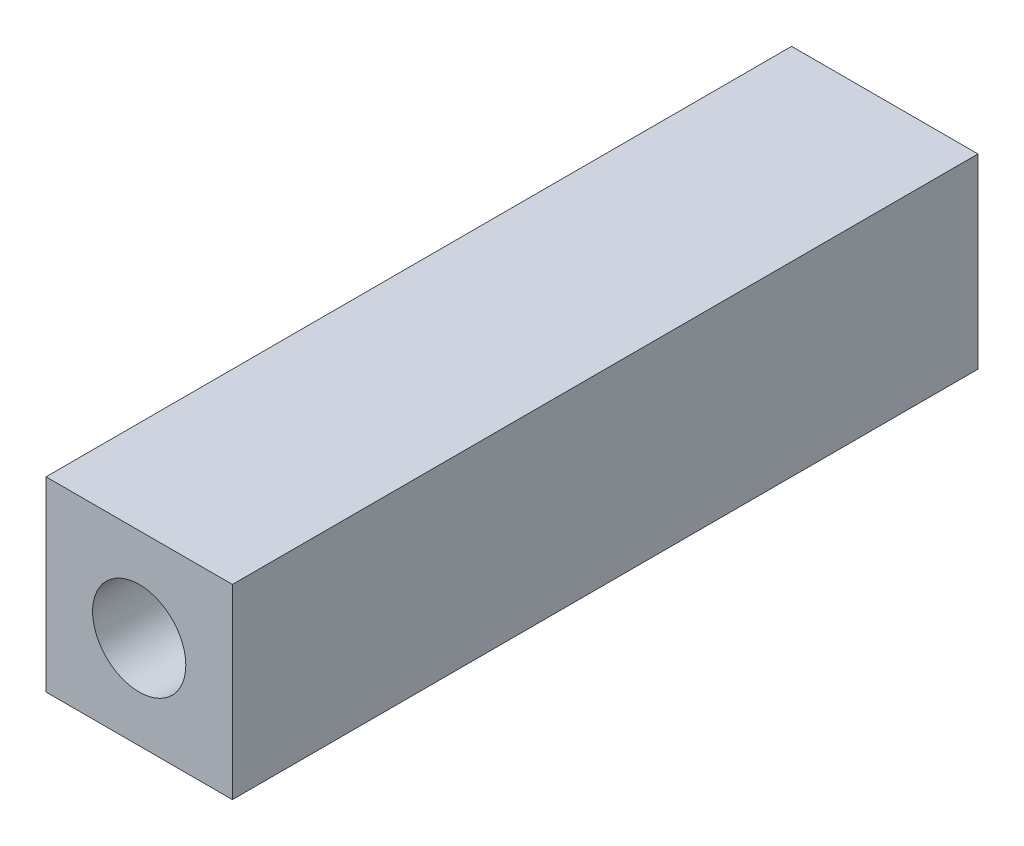
ISO-10303-21;
HEADER;
FILE_DESCRIPTION(('STEP AP214'),'2;1');
FILE_NAME('part.step','',(''),(''),'','','');
FILE_SCHEMA(('AUTOMOTIVE_DESIGN { 1 0 10303 214 1 1 1 1 }'));
ENDSEC;
DATA;
#1=APPLICATION_CONTEXT('core data for automotive mechanical design processes');
#2=APPLICATION_PROTOCOL_DEFINITION('international standard','automotive_design',2000,#1);
#3=PRODUCT_CONTEXT('',#1,'mechanical');
#4=PRODUCT('Part','Part','',(#3));
#5=PRODUCT_RELATED_PRODUCT_CATEGORY('part','',(#4));
#6=PRODUCT_DEFINITION_FORMATION('','',#4);
#7=PRODUCT_DEFINITION_CONTEXT('part definition',#1,'design');
#8=PRODUCT_DEFINITION('design','',#6,#7);
#9=PRODUCT_DEFINITION_SHAPE('','',#8);
#10=(LENGTH_UNIT() NAMED_UNIT(*) SI_UNIT(.MILLI.,.METRE.));
#11=(NAMED_UNIT(*) PLANE_ANGLE_UNIT() SI_UNIT($,.RADIAN.));
#12=(NAMED_UNIT(*) SI_UNIT($,.STERADIAN.) SOLID_ANGLE_UNIT());
#13=UNCERTAINTY_MEASURE_WITH_UNIT(LENGTH_MEASURE(1.E-05),#10,'distance_accuracy_value','');
#14=(GEOMETRIC_REPRESENTATION_CONTEXT(3) GLOBAL_UNCERTAINTY_ASSIGNED_CONTEXT((#13)) GLOBAL_UNIT_ASSIGNED_CONTEXT((#10,
#11,#12)) REPRESENTATION_CONTEXT('',''));
#15=CARTESIAN_POINT('',(0.,0.,0.));
#16=DIRECTION('',(0.,0.,1.));
#17=DIRECTION('',(1.,0.,0.));
#18=AXIS2_PLACEMENT_3D('',#15,#16,#17);
#19=CARTESIAN_POINT('',(-5.,-4.99999999999964,40.0000000000002));
#20=DIRECTION('',(0.,0.,-1.00000000000003));
#21=DIRECTION('',(-1.,0.,0.));
#22=AXIS2_PLACEMENT_3D('',#19,#20,#21);
#23=PLANE('',#22);
#24=DIRECTION('',(0.,-1.,0.));
#25=VECTOR('',#24,1.);
#26=CARTESIAN_POINT('',(-5.,-4.99999999999964,40.0000000000002));
#27=LINE('',#26,#25);
#28=CARTESIAN_POINT('',(-4.99999999999895,4.99999999999837,39.9999999999999));
#29=VERTEX_POINT('',#28);
#30=CARTESIAN_POINT('',(-5.,-4.99999999999964,40.0000000000002));
#31=VERTEX_POINT('',#30);
#32=EDGE_CURVE('E99',#29,#31,#27,.T.);
#33=ORIENTED_EDGE('',*,*,#32,.T.);
#34=DIRECTION('',(1.,0.,0.));
#35=VECTOR('',#34,1.);
#36=CARTESIAN_POINT('',(-5.,-4.99999999999964,40.0000000000002));
#37=LINE('',#36,#35);
#38=CARTESIAN_POINT('',(5.,-4.99999999999964,40.));
#39=VERTEX_POINT('',#38);
#40=EDGE_CURVE('E102',#31,#39,#37,.T.);
#41=ORIENTED_EDGE('',*,*,#40,.T.);
#42=DIRECTION('',(0.,1.,0.));
#43=VECTOR('',#42,1.);
#44=CARTESIAN_POINT('',(5.,-4.99999999999964,40.));
#45=LINE('',#44,#43);
#46=CARTESIAN_POINT('',(5.00000000000023,4.99999999999978,40.0000000000001));
#47=VERTEX_POINT('',#46);
#48=EDGE_CURVE('E104',#39,#47,#45,.T.);
#49=ORIENTED_EDGE('',*,*,#48,.T.);
#50=DIRECTION('',(-1.,0.,0.));
#51=VECTOR('',#50,1.);
#52=CARTESIAN_POINT('',(-4.99999999999895,4.99999999999837,39.9999999999999));
#53=LINE('',#52,#51);
#54=EDGE_CURVE('E106',#47,#29,#53,.T.);
#55=ORIENTED_EDGE('',*,*,#54,.T.);
#56=EDGE_LOOP('',(#33,#41,#49,#55));
#57=FACE_BOUND('',#56,.T.);
#58=CARTESIAN_POINT('',(1.11022302462516E-13,2.4980018054066E-13,40.0000000000001));
#59=DIRECTION('',(0.,0.,1.00000000000003));
#60=DIRECTION('',(1.,0.,0.));
#61=AXIS2_PLACEMENT_3D('',#58,#59,#60);
#62=CIRCLE('',#61,2.5);
#63=CARTESIAN_POINT('',(2.50000000000012,2.49414204567255E-13,40.0000000000001));
#64=VERTEX_POINT('',#63);
#65=EDGE_CURVE('E77',#64,#64,#62,.T.);
#66=ORIENTED_EDGE('',*,*,#65,.F.);
#67=EDGE_LOOP('',(#66));
#68=FACE_BOUND('',#67,.T.);
#69=ADVANCED_FACE('F16',(#57,#68),#23,.F.);
#70=CARTESIAN_POINT('',(-5.00000000000006,-5.00000000000012,-6.10622663543836E-13));
#71=DIRECTION('',(0.,0.,-1.00000000000003));
#72=DIRECTION('',(-1.,0.,0.));
#73=AXIS2_PLACEMENT_3D('',#70,#71,#72);
#74=PLANE('',#73);
#75=DIRECTION('',(0.,-1.,0.));
#76=VECTOR('',#75,1.);
#77=CARTESIAN_POINT('',(-5.00000000000006,-5.00000000000012,-6.10622663543836E-13));
#78=LINE('',#77,#76);
#79=CARTESIAN_POINT('',(-4.99999999999573,4.99999999999892,-2.22044604925031E-12));
#80=VERTEX_POINT('',#79);
#81=CARTESIAN_POINT('',(-5.00000000000006,-5.00000000000012,-6.10622663543836E-13));
#82=VERTEX_POINT('',#81);
#83=EDGE_CURVE('E84',#80,#82,#78,.T.);
#84=ORIENTED_EDGE('',*,*,#83,.F.);
#85=DIRECTION('',(-1.,0.,0.));
#86=VECTOR('',#85,1.);
#87=CARTESIAN_POINT('',(-4.99999999999573,4.99999999999892,-2.22044604925031E-12));
#88=LINE('',#87,#86);
#89=CARTESIAN_POINT('',(5.00000000000089,4.99999999999645,-1.33226762955019E-12));
#90=VERTEX_POINT('',#89);
#91=EDGE_CURVE('E97',#90,#80,#88,.T.);
#92=ORIENTED_EDGE('',*,*,#91,.F.);
#93=DIRECTION('',(0.,1.,0.));
#94=VECTOR('',#93,1.);
#95=CARTESIAN_POINT('',(5.00000000000356,-5.0000000000017,-1.66533453693773E-12));
#96=LINE('',#95,#94);
#97=CARTESIAN_POINT('',(5.00000000000356,-5.0000000000017,-1.66533453693773E-12));
#98=VERTEX_POINT('',#97);
#99=EDGE_CURVE('E95',#98,#90,#96,.T.);
#100=ORIENTED_EDGE('',*,*,#99,.F.);
#101=DIRECTION('',(1.,0.,0.));
#102=VECTOR('',#101,1.);
#103=CARTESIAN_POINT('',(-5.00000000000006,-5.00000000000012,-6.10622663543836E-13));
#104=LINE('',#103,#102);
#105=EDGE_CURVE('E93',#82,#98,#104,.T.);
#106=ORIENTED_EDGE('',*,*,#105,.F.);
#107=EDGE_LOOP('',(#84,#92,#100,#106));
#108=FACE_BOUND('',#107,.T.);
#109=CARTESIAN_POINT('',(1.11022302462516E-13,0.,-6.10622663543836E-13));
#110=DIRECTION('',(0.,0.,1.00000000000003));
#111=DIRECTION('',(1.,0.,0.));
#112=AXIS2_PLACEMENT_3D('',#109,#110,#111);
#113=CIRCLE('',#112,2.5);
#114=CARTESIAN_POINT('',(2.50000000000012,0.,-6.44206910038747E-13));
#115=VERTEX_POINT('',#114);
#116=EDGE_CURVE('E80',#115,#115,#113,.T.);
#117=ORIENTED_EDGE('',*,*,#116,.T.);
#118=EDGE_LOOP('',(#117));
#119=FACE_BOUND('',#118,.T.);
#120=ADVANCED_FACE('F130',(#108,#119),#74,.T.);
#121=CARTESIAN_POINT('',(-5.,-4.99999999999964,40.0000000000002));
#122=DIRECTION('',(1.,0.,0.));
#123=DIRECTION('',(0.,0.,-1.00000000000003));
#124=AXIS2_PLACEMENT_3D('',#121,#122,#123);
#125=PLANE('',#124);
#126=CARTESIAN_POINT('',(-4.99999999999856,0.,4.99999999999889));
#127=DIRECTION('',(1.,0.,0.));
#128=DIRECTION('',(0.,0.,-1.00000000000003));
#129=AXIS2_PLACEMENT_3D('',#126,#127,#128);
#130=CIRCLE('',#129,2.5);
#131=CARTESIAN_POINT('',(-4.99999999999853,0.,2.49999999999882));
#132=VERTEX_POINT('',#131);
#133=EDGE_CURVE('E82',#132,#132,#130,.T.);
#134=ORIENTED_EDGE('',*,*,#133,.T.);
#135=EDGE_LOOP('',(#134));
#136=FACE_BOUND('',#135,.T.);
#137=ORIENTED_EDGE('',*,*,#83,.T.);
#138=DIRECTION('',(0.,0.,-1.00000000000003));
#139=VECTOR('',#138,1.);
#140=CARTESIAN_POINT('',(-5.,-4.99999999999964,40.0000000000002));
#141=LINE('',#140,#139);
#142=EDGE_CURVE('E117',#31,#82,#141,.T.);
#143=ORIENTED_EDGE('',*,*,#142,.F.);
#144=ORIENTED_EDGE('',*,*,#32,.F.);
#145=DIRECTION('',(0.,0.,-1.00000000000003));
#146=VECTOR('',#145,1.);
#147=CARTESIAN_POINT('',(-4.99999999999895,4.99999999999837,39.9999999999999));
#148=LINE('',#147,#146);
#149=EDGE_CURVE('E108',#29,#80,#148,.T.);
#150=ORIENTED_EDGE('',*,*,#149,.T.);
#151=EDGE_LOOP('',(#137,#143,#144,#150));
#152=FACE_BOUND('',#151,.T.);
#153=ADVANCED_FACE('F18',(#136,#152),#125,.F.);
#154=CARTESIAN_POINT('',(-5.,-4.99999999999964,40.0000000000002));
#155=DIRECTION('',(0.,1.,0.));
#156=DIRECTION('',(0.,0.,1.00000000000003));
#157=AXIS2_PLACEMENT_3D('',#154,#155,#156);
#158=PLANE('',#157);
#159=CARTESIAN_POINT('',(0.,-5.,30.));
#160=DIRECTION('',(0.,1.,0.));
#161=DIRECTION('',(0.,0.,1.00000000000003));
#162=AXIS2_PLACEMENT_3D('',#159,#160,#161);
#163=CIRCLE('',#162,2.5);
#164=CARTESIAN_POINT('',(0.,-5.00000000000001,32.5000000000001));
#165=VERTEX_POINT('',#164);
#166=EDGE_CURVE('E87',#165,#165,#163,.T.);
#167=ORIENTED_EDGE('',*,*,#166,.T.);
#168=EDGE_LOOP('',(#167));
#169=FACE_BOUND('',#168,.T.);
#170=ORIENTED_EDGE('',*,*,#105,.T.);
#171=DIRECTION('',(0.,0.,-1.00000000000003));
#172=VECTOR('',#171,1.);
#173=CARTESIAN_POINT('',(5.,-4.99999999999964,40.));
#174=LINE('',#173,#172);
#175=EDGE_CURVE('E114',#39,#98,#174,.T.);
#176=ORIENTED_EDGE('',*,*,#175,.F.);
#177=ORIENTED_EDGE('',*,*,#40,.F.);
#178=ORIENTED_EDGE('',*,*,#142,.T.);
#179=EDGE_LOOP('',(#170,#176,#177,#178));
#180=FACE_BOUND('',#179,.T.);
#181=ADVANCED_FACE('F129',(#169,#180),#158,.F.);
#182=CARTESIAN_POINT('',(5.,-4.99999999999964,40.));
#183=DIRECTION('',(-1.,0.,0.));
#184=DIRECTION('',(0.,0.,1.00000000000003));
#185=AXIS2_PLACEMENT_3D('',#182,#183,#184);
#186=PLANE('',#185);
#187=ORIENTED_EDGE('',*,*,#99,.T.);
#188=DIRECTION('',(0.,0.,-1.00000000000003));
#189=VECTOR('',#188,1.);
#190=CARTESIAN_POINT('',(5.00000000000023,4.99999999999978,40.0000000000001));
#191=LINE('',#190,#189);
#192=EDGE_CURVE('E111',#47,#90,#191,.T.);
#193=ORIENTED_EDGE('',*,*,#192,.F.);
#194=ORIENTED_EDGE('',*,*,#48,.F.);
#195=ORIENTED_EDGE('',*,*,#175,.T.);
#196=EDGE_LOOP('',(#187,#193,#194,#195));
#197=FACE_BOUND('',#196,.T.);
#198=ADVANCED_FACE('F147',(#197),#186,.F.);
#199=CARTESIAN_POINT('',(-4.99999999999895,4.99999999999837,39.9999999999999));
#200=DIRECTION('',(0.,-1.,0.));
#201=DIRECTION('',(1.,0.,0.));
#202=AXIS2_PLACEMENT_3D('',#199,#200,#201);
#203=PLANE('',#202);
#204=ORIENTED_EDGE('',*,*,#91,.T.);
#205=ORIENTED_EDGE('',*,*,#149,.F.);
#206=ORIENTED_EDGE('',*,*,#54,.F.);
#207=ORIENTED_EDGE('',*,*,#192,.T.);
#208=EDGE_LOOP('',(#204,#205,#206,#207));
#209=FACE_BOUND('',#208,.T.);
#210=ADVANCED_FACE('F71',(#209),#203,.F.);
#211=CARTESIAN_POINT('',(1.11022302462516E-13,2.4980018054066E-13,40.0000000000001));
#212=DIRECTION('',(0.,0.,-1.00000000000003));
#213=DIRECTION('',(-1.,0.,0.));
#214=AXIS2_PLACEMENT_3D('',#211,#212,#213);
#215=CYLINDRICAL_SURFACE('',#214,2.5);
#216=CARTESIAN_POINT('',(0.,-1.97064586870965E-12,30.));
#217=DIRECTION('',(0.,0.707106781186549,-0.707106781186563));
#218=DIRECTION('',(0.,-0.707106781186549,-0.707106781186562));
#219=AXIS2_PLACEMENT_3D('',#216,#217,#218);
#220=ELLIPSE('',#219,3.53553390593274,2.5);
#221=CARTESIAN_POINT('',(2.50000000000017,-1.85962356624714E-12,29.9999999999991));
#222=VERTEX_POINT('',#221);
#223=CARTESIAN_POINT('',(-2.50000000000017,-1.97064586870965E-12,29.9999999999993));
#224=VERTEX_POINT('',#223);
#225=EDGE_CURVE('E11',#222,#224,#220,.T.);
#226=ORIENTED_EDGE('',*,*,#225,.F.);
#227=CARTESIAN_POINT('',(0.,-1.97064586870965E-12,30.));
#228=DIRECTION('',(0.,-0.707106781186549,-0.707106781186562));
#229=DIRECTION('',(0.,0.707106781186549,-0.707106781186563));
#230=AXIS2_PLACEMENT_3D('',#227,#228,#229);
#231=ELLIPSE('',#230,3.53553390593274,2.5);
#232=EDGE_CURVE('E24',#224,#222,#231,.F.);
#233=ORIENTED_EDGE('',*,*,#232,.F.);
#234=EDGE_LOOP('',(#226,#233));
#235=FACE_BOUND('',#234,.T.);
#236=CARTESIAN_POINT('',(4.16333634234434E-12,-1.36002320516582E-12,4.99999999999962));
#237=DIRECTION('',(0.707106781186565,0.,-0.707106781186576));
#238=DIRECTION('',(-0.707106781186546,0.,-0.707106781186548));
#239=AXIS2_PLACEMENT_3D('',#236,#237,#238);
#240=ELLIPSE('',#239,3.53553390593274,2.5);
#241=CARTESIAN_POINT('',(2.16493489801906E-12,-2.50000000000219,4.99999999999917));
#242=VERTEX_POINT('',#241);
#243=CARTESIAN_POINT('',(8.32667268468867E-13,2.49999999999653,5.00000000000023));
#244=VERTEX_POINT('',#243);
#245=EDGE_CURVE('E35',#242,#244,#240,.T.);
#246=ORIENTED_EDGE('',*,*,#245,.F.);
#247=CARTESIAN_POINT('',(4.16333634234434E-12,-1.36002320516582E-12,4.99999999999962));
#248=DIRECTION('',(-0.707106781186546,0.,-0.707106781186548));
#249=DIRECTION('',(0.707106781186565,0.,-0.707106781186576));
#250=AXIS2_PLACEMENT_3D('',#247,#248,#249);
#251=ELLIPSE('',#250,3.53553390593274,2.5);
#252=EDGE_CURVE('E120',#244,#242,#251,.F.);
#253=ORIENTED_EDGE('',*,*,#252,.F.);
#254=EDGE_LOOP('',(#246,#253));
#255=FACE_BOUND('',#254,.T.);
#256=ORIENTED_EDGE('',*,*,#65,.T.);
#257=EDGE_LOOP('',(#256));
#258=FACE_BOUND('',#257,.T.);
#259=ORIENTED_EDGE('',*,*,#116,.F.);
#260=EDGE_LOOP('',(#259));
#261=FACE_BOUND('',#260,.T.);
#262=ADVANCED_FACE('F67',(#235,#255,#258,#261),#215,.F.);
#263=CARTESIAN_POINT('',(-4.99999999999856,0.,4.99999999999889));
#264=DIRECTION('',(1.,0.,0.));
#265=DIRECTION('',(0.,0.,-1.00000000000003));
#266=AXIS2_PLACEMENT_3D('',#263,#264,#265);
#267=CYLINDRICAL_SURFACE('',#266,2.5);
#268=ORIENTED_EDGE('',*,*,#245,.T.);
#269=ORIENTED_EDGE('',*,*,#252,.T.);
#270=EDGE_LOOP('',(#268,#269));
#271=FACE_BOUND('',#270,.T.);
#272=ORIENTED_EDGE('',*,*,#133,.F.);
#273=EDGE_LOOP('',(#272));
#274=FACE_BOUND('',#273,.T.);
#275=ADVANCED_FACE('F70',(#271,#274),#267,.F.);
#276=CARTESIAN_POINT('',(0.,-5.,30.));
#277=DIRECTION('',(0.,1.,0.));
#278=DIRECTION('',(0.,0.,1.00000000000003));
#279=AXIS2_PLACEMENT_3D('',#276,#277,#278);
#280=CYLINDRICAL_SURFACE('',#279,2.5);
#281=ORIENTED_EDGE('',*,*,#225,.T.);
#282=ORIENTED_EDGE('',*,*,#232,.T.);
#283=EDGE_LOOP('',(#281,#282));
#284=FACE_BOUND('',#283,.T.);
#285=ORIENTED_EDGE('',*,*,#166,.F.);
#286=EDGE_LOOP('',(#285));
#287=FACE_BOUND('',#286,.T.);
#288=ADVANCED_FACE('F64',(#284,#287),#280,.F.);
#289=CLOSED_SHELL('',(#69,#120,#153,#181,#198,#210,#262,#275,#288));
#290=MANIFOLD_SOLID_BREP('B1',#289);
#291=ADVANCED_BREP_SHAPE_REPRESENTATION('',(#18,#290),#14);
#292=SHAPE_DEFINITION_REPRESENTATION(#9,#291);
ENDSEC;
END-ISO-10303-21;
